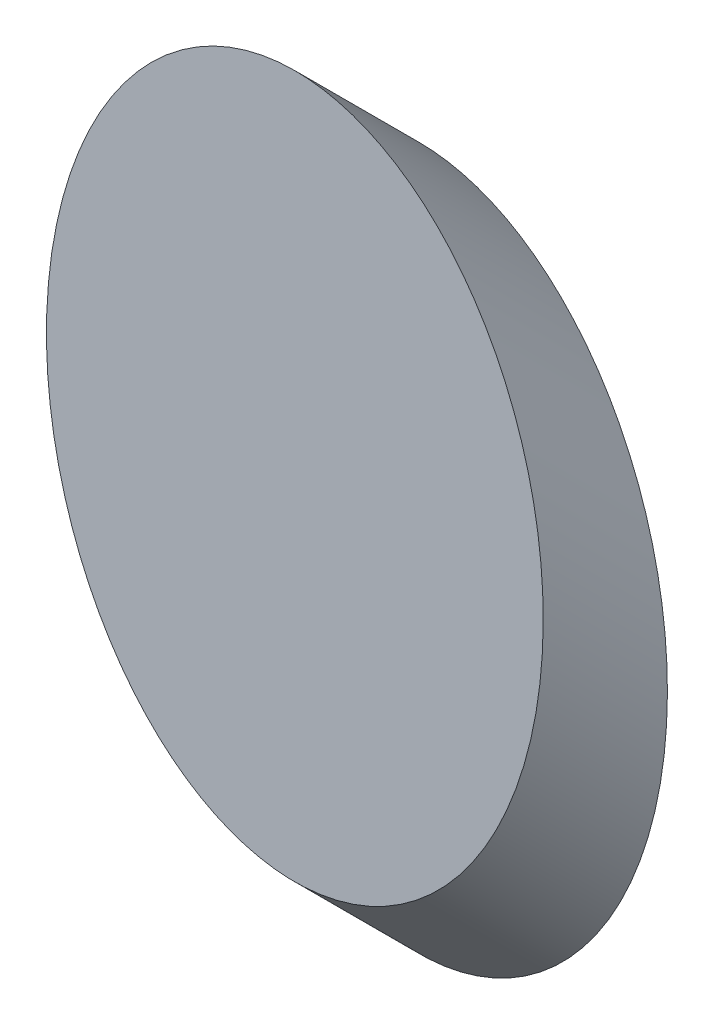
ISO-10303-21;
HEADER;
FILE_DESCRIPTION(('STEP AP214'),'2;1');
FILE_NAME('part.step','',(''),(''),'','','');
FILE_SCHEMA(('AUTOMOTIVE_DESIGN { 1 0 10303 214 1 1 1 1 }'));
ENDSEC;
DATA;
#1=APPLICATION_CONTEXT('core data for automotive mechanical design processes');
#2=APPLICATION_PROTOCOL_DEFINITION('international standard','automotive_design',2000,#1);
#3=PRODUCT_CONTEXT('',#1,'mechanical');
#4=PRODUCT('Part','Part','',(#3));
#5=PRODUCT_RELATED_PRODUCT_CATEGORY('part','',(#4));
#6=PRODUCT_DEFINITION_FORMATION('','',#4);
#7=PRODUCT_DEFINITION_CONTEXT('part definition',#1,'design');
#8=PRODUCT_DEFINITION('design','',#6,#7);
#9=PRODUCT_DEFINITION_SHAPE('','',#8);
#10=(LENGTH_UNIT() NAMED_UNIT(*) SI_UNIT(.MILLI.,.METRE.));
#11=(NAMED_UNIT(*) PLANE_ANGLE_UNIT() SI_UNIT($,.RADIAN.));
#12=(NAMED_UNIT(*) SI_UNIT($,.STERADIAN.) SOLID_ANGLE_UNIT());
#13=UNCERTAINTY_MEASURE_WITH_UNIT(LENGTH_MEASURE(1.E-05),#10,'distance_accuracy_value','');
#14=(GEOMETRIC_REPRESENTATION_CONTEXT(3) GLOBAL_UNCERTAINTY_ASSIGNED_CONTEXT((#13)) GLOBAL_UNIT_ASSIGNED_CONTEXT((#10,
#11,#12)) REPRESENTATION_CONTEXT('',''));
#15=CARTESIAN_POINT('',(0.,0.,0.));
#16=DIRECTION('',(0.,0.,1.));
#17=DIRECTION('',(1.,0.,0.));
#18=AXIS2_PLACEMENT_3D('',#15,#16,#17);
#19=CARTESIAN_POINT('',(54.3923829817161,15.788871530322,-20.));
#20=DIRECTION('',(0.,0.,1.));
#21=DIRECTION('',(0.,1.,0.));
#22=AXIS2_PLACEMENT_3D('',#19,#20,#21);
#23=ELLIPSE('',#22,56.575,40.);
#24=DIRECTION('',(0.,0.707106781186549,0.707106781186545));
#25=VECTOR('',#24,1.);
#26=SURFACE_OF_LINEAR_EXTRUSION('',#23,#25);
#27=CARTESIAN_POINT('',(54.3923829817161,72.363871530322,-20.));
#28=VERTEX_POINT('',#27);
#29=EDGE_CURVE('E10',#28,#28,#23,.T.);
#30=ORIENTED_EDGE('',*,*,#29,.T.);
#31=EDGE_LOOP('',(#30));
#32=FACE_BOUND('',#31,.T.);
#33=CARTESIAN_POINT('',(54.3923829817161,35.7888715303221,0.));
#34=DIRECTION('',(0.,0.,1.));
#35=DIRECTION('',(0.,1.,0.));
#36=AXIS2_PLACEMENT_3D('',#33,#34,#35);
#37=ELLIPSE('',#36,56.575,40.);
#38=CARTESIAN_POINT('',(54.3923829817161,92.3638715303221,0.));
#39=VERTEX_POINT('',#38);
#40=EDGE_CURVE('E36',#39,#39,#37,.T.);
#41=ORIENTED_EDGE('',*,*,#40,.F.);
#42=EDGE_LOOP('',(#41));
#43=FACE_BOUND('',#42,.T.);
#44=ADVANCED_FACE('F32',(#32,#43),#26,.T.);
#45=CARTESIAN_POINT('',(54.3923829817161,15.788871530322,-20.));
#46=DIRECTION('',(0.,0.,1.));
#47=DIRECTION('',(1.,0.,0.));
#48=AXIS2_PLACEMENT_3D('',#45,#46,#47);
#49=PLANE('',#48);
#50=ORIENTED_EDGE('',*,*,#29,.F.);
#51=EDGE_LOOP('',(#50));
#52=FACE_BOUND('',#51,.T.);
#53=ADVANCED_FACE('F48',(#52),#49,.F.);
#54=CARTESIAN_POINT('',(54.3923829817161,35.7888715303221,0.));
#55=DIRECTION('',(0.,0.,1.));
#56=DIRECTION('',(1.,0.,0.));
#57=AXIS2_PLACEMENT_3D('',#54,#55,#56);
#58=PLANE('',#57);
#59=ORIENTED_EDGE('',*,*,#40,.T.);
#60=EDGE_LOOP('',(#59));
#61=FACE_BOUND('',#60,.T.);
#62=ADVANCED_FACE('F45',(#61),#58,.T.);
#63=CLOSED_SHELL('',(#44,#53,#62));
#64=MANIFOLD_SOLID_BREP('B2',#63);
#65=ADVANCED_BREP_SHAPE_REPRESENTATION('',(#18,#64),#14);
#66=SHAPE_DEFINITION_REPRESENTATION(#9,#65);
ENDSEC;
END-ISO-10303-21;
